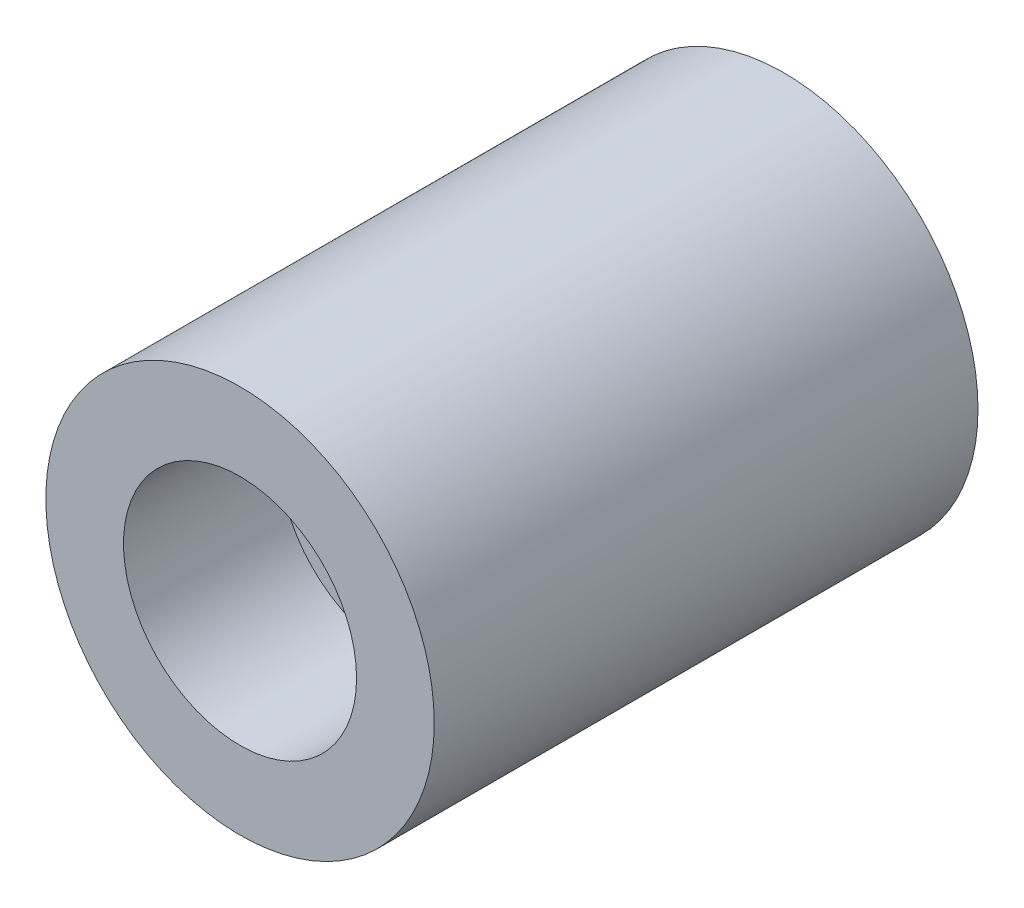
ISO-10303-21;
HEADER;
FILE_DESCRIPTION(('STEP AP214'),'2;1');
FILE_NAME('part.step','',(''),(''),'','','');
FILE_SCHEMA(('AUTOMOTIVE_DESIGN { 1 0 10303 214 1 1 1 1 }'));
ENDSEC;
DATA;
#1=APPLICATION_CONTEXT('core data for automotive mechanical design processes');
#2=APPLICATION_PROTOCOL_DEFINITION('international standard','automotive_design',2000,#1);
#3=PRODUCT_CONTEXT('',#1,'mechanical');
#4=PRODUCT('Part','Part','',(#3));
#5=PRODUCT_RELATED_PRODUCT_CATEGORY('part','',(#4));
#6=PRODUCT_DEFINITION_FORMATION('','',#4);
#7=PRODUCT_DEFINITION_CONTEXT('part definition',#1,'design');
#8=PRODUCT_DEFINITION('design','',#6,#7);
#9=PRODUCT_DEFINITION_SHAPE('','',#8);
#10=(LENGTH_UNIT() NAMED_UNIT(*) SI_UNIT(.MILLI.,.METRE.));
#11=(NAMED_UNIT(*) PLANE_ANGLE_UNIT() SI_UNIT($,.RADIAN.));
#12=(NAMED_UNIT(*) SI_UNIT($,.STERADIAN.) SOLID_ANGLE_UNIT());
#13=UNCERTAINTY_MEASURE_WITH_UNIT(LENGTH_MEASURE(1.E-05),#10,'distance_accuracy_value','');
#14=(GEOMETRIC_REPRESENTATION_CONTEXT(3) GLOBAL_UNCERTAINTY_ASSIGNED_CONTEXT((#13)) GLOBAL_UNIT_ASSIGNED_CONTEXT((#10,
#11,#12)) REPRESENTATION_CONTEXT('',''));
#15=CARTESIAN_POINT('',(0.,0.,0.));
#16=DIRECTION('',(0.,0.,1.));
#17=DIRECTION('',(1.,0.,0.));
#18=AXIS2_PLACEMENT_3D('',#15,#16,#17);
#19=CARTESIAN_POINT('',(0.,0.,140.));
#20=DIRECTION('',(0.,0.,-1.));
#21=DIRECTION('',(-1.,0.,0.));
#22=AXIS2_PLACEMENT_3D('',#19,#20,#21);
#23=CYLINDRICAL_SURFACE('',#22,50.);
#24=CARTESIAN_POINT('',(0.,0.,140.));
#25=DIRECTION('',(0.,0.,1.));
#26=DIRECTION('',(1.,0.,0.));
#27=AXIS2_PLACEMENT_3D('',#24,#25,#26);
#28=CIRCLE('',#27,50.);
#29=CARTESIAN_POINT('',(50.,0.,140.));
#30=VERTEX_POINT('',#29);
#31=EDGE_CURVE('E10',#30,#30,#28,.T.);
#32=ORIENTED_EDGE('',*,*,#31,.F.);
#33=EDGE_LOOP('',(#32));
#34=FACE_BOUND('',#33,.T.);
#35=CARTESIAN_POINT('',(0.,0.,0.));
#36=DIRECTION('',(0.,0.,1.));
#37=DIRECTION('',(1.,0.,0.));
#38=AXIS2_PLACEMENT_3D('',#35,#36,#37);
#39=CIRCLE('',#38,50.);
#40=CARTESIAN_POINT('',(50.,0.,0.));
#41=VERTEX_POINT('',#40);
#42=EDGE_CURVE('E34',#41,#41,#39,.T.);
#43=ORIENTED_EDGE('',*,*,#42,.T.);
#44=EDGE_LOOP('',(#43));
#45=FACE_BOUND('',#44,.T.);
#46=ADVANCED_FACE('F31',(#34,#45),#23,.T.);
#47=CARTESIAN_POINT('',(0.,0.,140.));
#48=DIRECTION('',(0.,0.,1.));
#49=DIRECTION('',(1.,0.,0.));
#50=AXIS2_PLACEMENT_3D('',#47,#48,#49);
#51=PLANE('',#50);
#52=CARTESIAN_POINT('',(0.,0.,140.));
#53=DIRECTION('',(0.,0.,1.));
#54=DIRECTION('',(1.,0.,0.));
#55=AXIS2_PLACEMENT_3D('',#52,#53,#54);
#56=CIRCLE('',#55,30.);
#57=CARTESIAN_POINT('',(30.,0.,140.));
#58=VERTEX_POINT('',#57);
#59=EDGE_CURVE('E43',#58,#58,#56,.T.);
#60=ORIENTED_EDGE('',*,*,#59,.F.);
#61=EDGE_LOOP('',(#60));
#62=FACE_BOUND('',#61,.T.);
#63=ORIENTED_EDGE('',*,*,#31,.T.);
#64=EDGE_LOOP('',(#63));
#65=FACE_BOUND('',#64,.T.);
#66=ADVANCED_FACE('F76',(#62,#65),#51,.T.);
#67=CARTESIAN_POINT('',(0.,0.,0.));
#68=DIRECTION('',(0.,0.,1.));
#69=DIRECTION('',(1.,0.,0.));
#70=AXIS2_PLACEMENT_3D('',#67,#68,#69);
#71=PLANE('',#70);
#72=ORIENTED_EDGE('',*,*,#42,.F.);
#73=EDGE_LOOP('',(#72));
#74=FACE_BOUND('',#73,.T.);
#75=ADVANCED_FACE('F72',(#74),#71,.F.);
#76=CARTESIAN_POINT('',(0.,0.,100.));
#77=DIRECTION('',(0.,0.,1.));
#78=DIRECTION('',(1.,0.,0.));
#79=AXIS2_PLACEMENT_3D('',#76,#77,#78);
#80=CYLINDRICAL_SURFACE('',#79,30.);
#81=CARTESIAN_POINT('',(0.,0.,100.));
#82=DIRECTION('',(0.,0.,1.));
#83=DIRECTION('',(1.,0.,0.));
#84=AXIS2_PLACEMENT_3D('',#81,#82,#83);
#85=CIRCLE('',#84,30.);
#86=CARTESIAN_POINT('',(30.,0.,100.));
#87=VERTEX_POINT('',#86);
#88=EDGE_CURVE('E41',#87,#87,#85,.T.);
#89=ORIENTED_EDGE('',*,*,#88,.F.);
#90=EDGE_LOOP('',(#89));
#91=FACE_BOUND('',#90,.T.);
#92=ORIENTED_EDGE('',*,*,#59,.T.);
#93=EDGE_LOOP('',(#92));
#94=FACE_BOUND('',#93,.T.);
#95=ADVANCED_FACE('F66',(#91,#94),#80,.F.);
#96=CARTESIAN_POINT('',(0.,0.,100.));
#97=DIRECTION('',(0.,0.,1.));
#98=DIRECTION('',(1.,0.,0.));
#99=AXIS2_PLACEMENT_3D('',#96,#97,#98);
#100=PLANE('',#99);
#101=CARTESIAN_POINT('',(0.,0.,100.));
#102=DIRECTION('',(0.,0.,1.));
#103=DIRECTION('',(1.,0.,0.));
#104=AXIS2_PLACEMENT_3D('',#101,#102,#103);
#105=CIRCLE('',#104,10.);
#106=CARTESIAN_POINT('',(10.,0.,100.));
#107=VERTEX_POINT('',#106);
#108=EDGE_CURVE('E49',#107,#107,#105,.T.);
#109=ORIENTED_EDGE('',*,*,#108,.F.);
#110=EDGE_LOOP('',(#109));
#111=FACE_BOUND('',#110,.T.);
#112=ORIENTED_EDGE('',*,*,#88,.T.);
#113=EDGE_LOOP('',(#112));
#114=FACE_BOUND('',#113,.T.);
#115=ADVANCED_FACE('F60',(#111,#114),#100,.T.);
#116=CARTESIAN_POINT('',(0.,0.,20.));
#117=DIRECTION('',(0.,0.,1.));
#118=DIRECTION('',(1.,0.,0.));
#119=AXIS2_PLACEMENT_3D('',#116,#117,#118);
#120=CYLINDRICAL_SURFACE('',#119,10.);
#121=CARTESIAN_POINT('',(0.,0.,20.));
#122=DIRECTION('',(0.,0.,1.));
#123=DIRECTION('',(1.,0.,0.));
#124=AXIS2_PLACEMENT_3D('',#121,#122,#123);
#125=CIRCLE('',#124,10.);
#126=CARTESIAN_POINT('',(10.,0.,20.));
#127=VERTEX_POINT('',#126);
#128=EDGE_CURVE('E46',#127,#127,#125,.T.);
#129=ORIENTED_EDGE('',*,*,#128,.F.);
#130=EDGE_LOOP('',(#129));
#131=FACE_BOUND('',#130,.T.);
#132=ORIENTED_EDGE('',*,*,#108,.T.);
#133=EDGE_LOOP('',(#132));
#134=FACE_BOUND('',#133,.T.);
#135=ADVANCED_FACE('F57',(#131,#134),#120,.F.);
#136=CARTESIAN_POINT('',(0.,0.,20.));
#137=DIRECTION('',(0.,0.,1.));
#138=DIRECTION('',(1.,0.,0.));
#139=AXIS2_PLACEMENT_3D('',#136,#137,#138);
#140=PLANE('',#139);
#141=ORIENTED_EDGE('',*,*,#128,.T.);
#142=EDGE_LOOP('',(#141));
#143=FACE_BOUND('',#142,.T.);
#144=ADVANCED_FACE('F55',(#143),#140,.T.);
#145=CLOSED_SHELL('',(#46,#66,#75,#95,#115,#135,#144));
#146=MANIFOLD_SOLID_BREP('B2',#145);
#147=ADVANCED_BREP_SHAPE_REPRESENTATION('',(#18,#146),#14);
#148=SHAPE_DEFINITION_REPRESENTATION(#9,#147);
ENDSEC;
END-ISO-10303-21;
